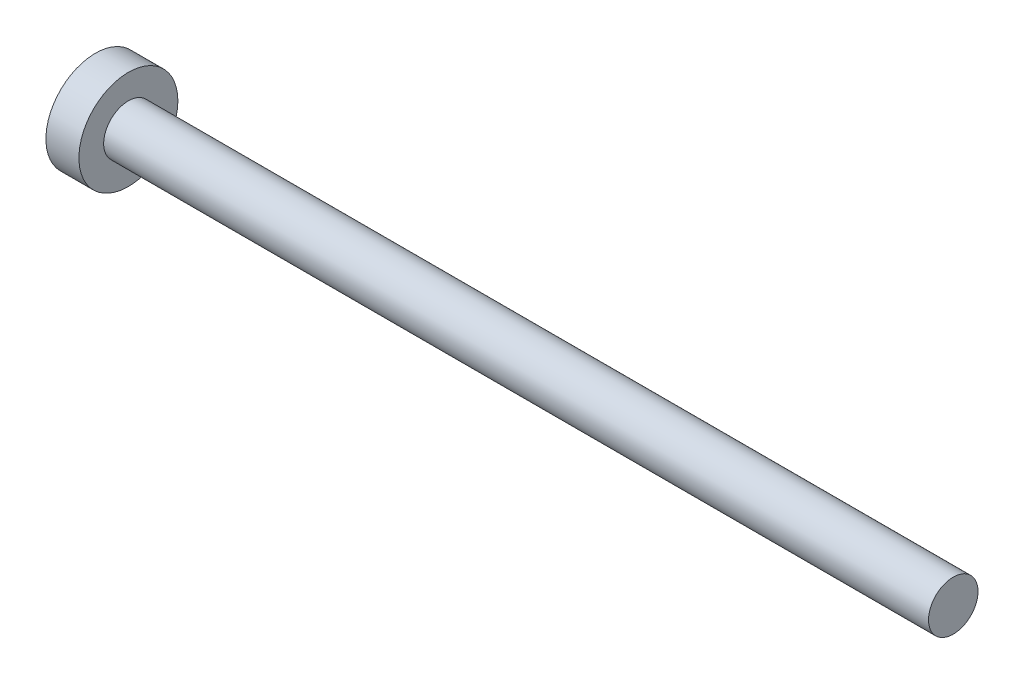
ISO-10303-21;
HEADER;
FILE_DESCRIPTION(('STEP AP214'),'2;1');
FILE_NAME('part.step','',(''),(''),'','','');
FILE_SCHEMA(('AUTOMOTIVE_DESIGN { 1 0 10303 214 1 1 1 1 }'));
ENDSEC;
DATA;
#1=APPLICATION_CONTEXT('core data for automotive mechanical design processes');
#2=APPLICATION_PROTOCOL_DEFINITION('international standard','automotive_design',2000,#1);
#3=PRODUCT_CONTEXT('',#1,'mechanical');
#4=PRODUCT('Part','Part','',(#3));
#5=PRODUCT_RELATED_PRODUCT_CATEGORY('part','',(#4));
#6=PRODUCT_DEFINITION_FORMATION('','',#4);
#7=PRODUCT_DEFINITION_CONTEXT('part definition',#1,'design');
#8=PRODUCT_DEFINITION('design','',#6,#7);
#9=PRODUCT_DEFINITION_SHAPE('','',#8);
#10=(LENGTH_UNIT() NAMED_UNIT(*) SI_UNIT(.MILLI.,.METRE.));
#11=(NAMED_UNIT(*) PLANE_ANGLE_UNIT() SI_UNIT($,.RADIAN.));
#12=(NAMED_UNIT(*) SI_UNIT($,.STERADIAN.) SOLID_ANGLE_UNIT());
#13=UNCERTAINTY_MEASURE_WITH_UNIT(LENGTH_MEASURE(1.E-05),#10,'distance_accuracy_value','');
#14=(GEOMETRIC_REPRESENTATION_CONTEXT(3) GLOBAL_UNCERTAINTY_ASSIGNED_CONTEXT((#13)) GLOBAL_UNIT_ASSIGNED_CONTEXT((#10,
#11,#12)) REPRESENTATION_CONTEXT('',''));
#15=CARTESIAN_POINT('',(0.,0.,0.));
#16=DIRECTION('',(0.,0.,1.));
#17=DIRECTION('',(1.,0.,0.));
#18=AXIS2_PLACEMENT_3D('',#15,#16,#17);
#19=CARTESIAN_POINT('',(2.,0.,0.));
#20=DIRECTION('',(-1.,0.,0.));
#21=DIRECTION('',(0.,0.,1.));
#22=AXIS2_PLACEMENT_3D('',#19,#20,#21);
#23=CYLINDRICAL_SURFACE('',#22,3.);
#24=CARTESIAN_POINT('',(2.,0.,0.));
#25=DIRECTION('',(1.,0.,0.));
#26=DIRECTION('',(0.,0.,-1.));
#27=AXIS2_PLACEMENT_3D('',#24,#25,#26);
#28=CIRCLE('',#27,3.);
#29=CARTESIAN_POINT('',(2.,0.,-3.));
#30=VERTEX_POINT('',#29);
#31=EDGE_CURVE('E38',#30,#30,#28,.T.);
#32=ORIENTED_EDGE('',*,*,#31,.F.);
#33=EDGE_LOOP('',(#32));
#34=FACE_BOUND('',#33,.T.);
#35=CARTESIAN_POINT('',(0.,0.,0.));
#36=DIRECTION('',(1.,0.,0.));
#37=DIRECTION('',(0.,0.,-1.));
#38=AXIS2_PLACEMENT_3D('',#35,#36,#37);
#39=CIRCLE('',#38,3.);
#40=CARTESIAN_POINT('',(0.,0.,-3.));
#41=VERTEX_POINT('',#40);
#42=EDGE_CURVE('E34',#41,#41,#39,.T.);
#43=ORIENTED_EDGE('',*,*,#42,.T.);
#44=EDGE_LOOP('',(#43));
#45=FACE_BOUND('',#44,.T.);
#46=ADVANCED_FACE('F31',(#34,#45),#23,.T.);
#47=CARTESIAN_POINT('',(2.,0.,0.));
#48=DIRECTION('',(1.,0.,0.));
#49=DIRECTION('',(0.,0.,-1.));
#50=AXIS2_PLACEMENT_3D('',#47,#48,#49);
#51=PLANE('',#50);
#52=CARTESIAN_POINT('',(2.,0.,0.));
#53=DIRECTION('',(1.,0.,0.));
#54=DIRECTION('',(0.,0.,-1.));
#55=AXIS2_PLACEMENT_3D('',#52,#53,#54);
#56=CIRCLE('',#55,1.5);
#57=CARTESIAN_POINT('',(2.,0.,-1.5));
#58=VERTEX_POINT('',#57);
#59=EDGE_CURVE('E10',#58,#58,#56,.T.);
#60=ORIENTED_EDGE('',*,*,#59,.F.);
#61=EDGE_LOOP('',(#60));
#62=FACE_BOUND('',#61,.T.);
#63=ORIENTED_EDGE('',*,*,#31,.T.);
#64=EDGE_LOOP('',(#63));
#65=FACE_BOUND('',#64,.T.);
#66=ADVANCED_FACE('F55',(#62,#65),#51,.T.);
#67=CARTESIAN_POINT('',(0.,0.,0.));
#68=DIRECTION('',(1.,0.,0.));
#69=DIRECTION('',(0.,0.,-1.));
#70=AXIS2_PLACEMENT_3D('',#67,#68,#69);
#71=PLANE('',#70);
#72=ORIENTED_EDGE('',*,*,#42,.F.);
#73=EDGE_LOOP('',(#72));
#74=FACE_BOUND('',#73,.T.);
#75=ADVANCED_FACE('F52',(#74),#71,.F.);
#76=CARTESIAN_POINT('',(52.,0.,0.));
#77=DIRECTION('',(-1.,0.,0.));
#78=DIRECTION('',(0.,0.,1.));
#79=AXIS2_PLACEMENT_3D('',#76,#77,#78);
#80=CYLINDRICAL_SURFACE('',#79,1.5);
#81=CARTESIAN_POINT('',(52.,0.,0.));
#82=DIRECTION('',(1.,0.,0.));
#83=DIRECTION('',(0.,0.,-1.));
#84=AXIS2_PLACEMENT_3D('',#81,#82,#83);
#85=CIRCLE('',#84,1.5);
#86=CARTESIAN_POINT('',(52.,0.,-1.5));
#87=VERTEX_POINT('',#86);
#88=EDGE_CURVE('E44',#87,#87,#85,.T.);
#89=ORIENTED_EDGE('',*,*,#88,.F.);
#90=EDGE_LOOP('',(#89));
#91=FACE_BOUND('',#90,.T.);
#92=ORIENTED_EDGE('',*,*,#59,.T.);
#93=EDGE_LOOP('',(#92));
#94=FACE_BOUND('',#93,.T.);
#95=ADVANCED_FACE('F54',(#91,#94),#80,.T.);
#96=CARTESIAN_POINT('',(52.,0.,0.));
#97=DIRECTION('',(1.,0.,0.));
#98=DIRECTION('',(0.,0.,-1.));
#99=AXIS2_PLACEMENT_3D('',#96,#97,#98);
#100=PLANE('',#99);
#101=ORIENTED_EDGE('',*,*,#88,.T.);
#102=EDGE_LOOP('',(#101));
#103=FACE_BOUND('',#102,.T.);
#104=ADVANCED_FACE('F60',(#103),#100,.T.);
#105=CLOSED_SHELL('',(#46,#66,#75,#95,#104));
#106=MANIFOLD_SOLID_BREP('B2',#105);
#107=ADVANCED_BREP_SHAPE_REPRESENTATION('',(#18,#106),#14);
#108=SHAPE_DEFINITION_REPRESENTATION(#9,#107);
ENDSEC;
END-ISO-10303-21;
